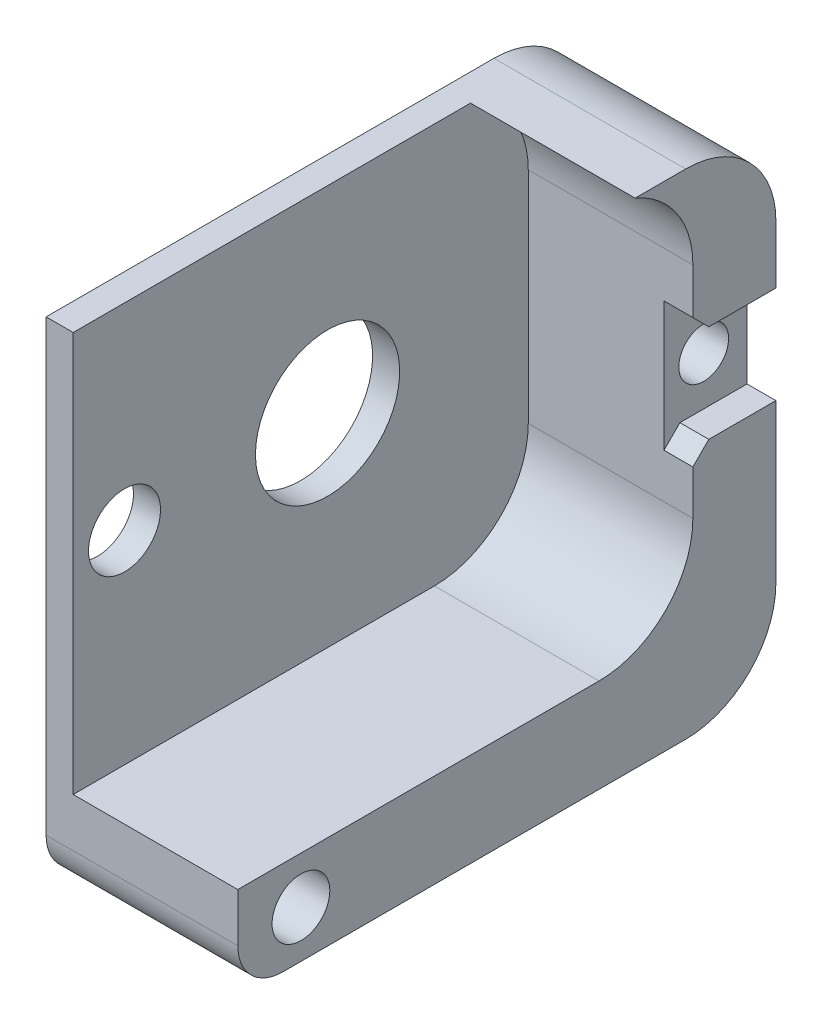
ISO-10303-21;
HEADER;
FILE_DESCRIPTION(('STEP AP214'),'2;1');
FILE_NAME('part.step','',(''),(''),'','','');
FILE_SCHEMA(('AUTOMOTIVE_DESIGN { 1 0 10303 214 1 1 1 1 }'));
ENDSEC;
DATA;
#1=APPLICATION_CONTEXT('core data for automotive mechanical design processes');
#2=APPLICATION_PROTOCOL_DEFINITION('international standard','automotive_design',2000,#1);
#3=PRODUCT_CONTEXT('',#1,'mechanical');
#4=PRODUCT('Part','Part','',(#3));
#5=PRODUCT_RELATED_PRODUCT_CATEGORY('part','',(#4));
#6=PRODUCT_DEFINITION_FORMATION('','',#4);
#7=PRODUCT_DEFINITION_CONTEXT('part definition',#1,'design');
#8=PRODUCT_DEFINITION('design','',#6,#7);
#9=PRODUCT_DEFINITION_SHAPE('','',#8);
#10=(LENGTH_UNIT() NAMED_UNIT(*) SI_UNIT(.MILLI.,.METRE.));
#11=(NAMED_UNIT(*) PLANE_ANGLE_UNIT() SI_UNIT($,.RADIAN.));
#12=(NAMED_UNIT(*) SI_UNIT($,.STERADIAN.) SOLID_ANGLE_UNIT());
#13=UNCERTAINTY_MEASURE_WITH_UNIT(LENGTH_MEASURE(1.E-05),#10,'distance_accuracy_value','');
#14=(GEOMETRIC_REPRESENTATION_CONTEXT(3) GLOBAL_UNCERTAINTY_ASSIGNED_CONTEXT((#13)) GLOBAL_UNIT_ASSIGNED_CONTEXT((#10,
#11,#12)) REPRESENTATION_CONTEXT('',''));
#15=CARTESIAN_POINT('',(0.,0.,0.));
#16=DIRECTION('',(0.,0.,1.));
#17=DIRECTION('',(1.,0.,0.));
#18=AXIS2_PLACEMENT_3D('',#15,#16,#17);
#19=CARTESIAN_POINT('',(-11.1667096211268,-21.3231281442154,-17.4703443811633));
#20=DIRECTION('',(1.,0.,0.));
#21=DIRECTION('',(0.,0.,-1.));
#22=AXIS2_PLACEMENT_3D('',#19,#20,#21);
#23=PLANE('',#22);
#24=CARTESIAN_POINT('',(-11.1667096211268,-18.8231281442155,-15.0703443811633));
#25=DIRECTION('',(1.,0.,0.));
#26=DIRECTION('',(0.,0.,-1.));
#27=AXIS2_PLACEMENT_3D('',#24,#25,#26);
#28=CIRCLE('',#27,1.38000000000005);
#29=CARTESIAN_POINT('',(-11.1667096211268,-18.8231281442155,-16.4503443811633));
#30=VERTEX_POINT('',#29);
#31=EDGE_CURVE('E13',#30,#30,#28,.F.);
#32=ORIENTED_EDGE('',*,*,#31,.T.);
#33=EDGE_LOOP('',(#32));
#34=FACE_BOUND('',#33,.T.);
#35=DIRECTION('',(0.,-1.,0.));
#36=VECTOR('',#35,1.);
#37=CARTESIAN_POINT('',(-11.1667096211268,0.,-17.4703443811632));
#38=LINE('',#37,#36);
#39=CARTESIAN_POINT('',(-11.1667096211268,-16.1231281442156,-17.4703443811632));
#40=VERTEX_POINT('',#39);
#41=CARTESIAN_POINT('',(-11.1667096211268,-21.5231281442154,-17.4703443811632));
#42=VERTEX_POINT('',#41);
#43=EDGE_CURVE('E418',#40,#42,#38,.T.);
#44=ORIENTED_EDGE('',*,*,#43,.F.);
#45=DIRECTION('',(0.,0.,-1.));
#46=VECTOR('',#45,1.);
#47=CARTESIAN_POINT('',(-11.1667096211268,-16.1231281442156,-17.4703443811633));
#48=LINE('',#47,#46);
#49=CARTESIAN_POINT('',(-11.1667096211268,-16.1231281442156,-13.7531870936376));
#50=VERTEX_POINT('',#49);
#51=EDGE_CURVE('E349',#50,#40,#48,.T.);
#52=ORIENTED_EDGE('',*,*,#51,.F.);
#53=DIRECTION('',(0.,-0.707106781186725,-0.70710678118637));
#54=VECTOR('',#53,1.);
#55=CARTESIAN_POINT('',(-11.1667096211268,-20.5817067879796,-18.2117657373994));
#56=LINE('',#55,#54);
#57=CARTESIAN_POINT('',(-11.1667096211268,-15.2402854317408,-12.8703443811633));
#58=VERTEX_POINT('',#57);
#59=EDGE_CURVE('E346',#58,#50,#56,.T.);
#60=ORIENTED_EDGE('',*,*,#59,.F.);
#61=DIRECTION('',(0.,1.,0.));
#62=VECTOR('',#61,1.);
#63=CARTESIAN_POINT('',(-11.1667096211268,0.,-12.8703443811633));
#64=LINE('',#63,#62);
#65=CARTESIAN_POINT('',(-11.1667096211268,-22.4059708566895,-12.8703443811633));
#66=VERTEX_POINT('',#65);
#67=EDGE_CURVE('E192',#66,#58,#64,.T.);
#68=ORIENTED_EDGE('',*,*,#67,.F.);
#69=DIRECTION('',(0.,-0.707106781186459,0.707106781186637));
#70=VECTOR('',#69,1.);
#71=CARTESIAN_POINT('',(-11.1667096211268,-19.5645495004526,-15.7117657374009));
#72=LINE('',#71,#70);
#73=CARTESIAN_POINT('',(-11.1667096211268,-21.5231281442154,-13.7531870936376));
#74=VERTEX_POINT('',#73);
#75=EDGE_CURVE('E407',#74,#66,#72,.T.);
#76=ORIENTED_EDGE('',*,*,#75,.F.);
#77=DIRECTION('',(0.,0.,1.));
#78=VECTOR('',#77,1.);
#79=CARTESIAN_POINT('',(-11.1667096211268,-21.5231281442154,-17.4703443811633));
#80=LINE('',#79,#78);
#81=EDGE_CURVE('E404',#42,#74,#80,.T.);
#82=ORIENTED_EDGE('',*,*,#81,.F.);
#83=EDGE_LOOP('',(#44,#52,#60,#68,#76,#82));
#84=FACE_BOUND('',#83,.T.);
#85=ADVANCED_FACE('F169',(#34,#84),#23,.T.);
#86=CARTESIAN_POINT('',(29.5047288698509,0.,-17.4703443811632));
#87=DIRECTION('',(0.,0.,-1.));
#88=DIRECTION('',(-1.,0.,0.));
#89=AXIS2_PLACEMENT_3D('',#86,#87,#88);
#90=PLANE('',#89);
#91=DIRECTION('',(-1.,0.,0.));
#92=VECTOR('',#91,1.);
#93=CARTESIAN_POINT('',(29.5047288698509,-12.9081281442156,-17.4703443811632));
#94=LINE('',#93,#92);
#95=CARTESIAN_POINT('',(-9.56670962112671,-12.9081281442156,-17.4703443811631));
#96=VERTEX_POINT('',#95);
#97=CARTESIAN_POINT('',(-20.1867111341527,-12.9081281442156,-17.4703443811631));
#98=VERTEX_POINT('',#97);
#99=EDGE_CURVE('E437',#96,#98,#94,.T.);
#100=ORIENTED_EDGE('',*,*,#99,.F.);
#101=DIRECTION('',(0.,1.,0.));
#102=VECTOR('',#101,1.);
#103=CARTESIAN_POINT('',(-9.56670962112671,-21.3231281442154,-17.4703443811632));
#104=LINE('',#103,#102);
#105=CARTESIAN_POINT('',(-9.56670962112671,-16.1231281442156,-17.4703443811632));
#106=VERTEX_POINT('',#105);
#107=EDGE_CURVE('E366',#106,#96,#104,.T.);
#108=ORIENTED_EDGE('',*,*,#107,.F.);
#109=DIRECTION('',(-1.,0.,0.));
#110=VECTOR('',#109,1.);
#111=CARTESIAN_POINT('',(23.2673742763642,-16.1231281442156,-17.4703443811632));
#112=LINE('',#111,#110);
#113=EDGE_CURVE('E352',#106,#40,#112,.T.);
#114=ORIENTED_EDGE('',*,*,#113,.T.);
#115=ORIENTED_EDGE('',*,*,#43,.T.);
#116=DIRECTION('',(-1.,0.,0.));
#117=VECTOR('',#116,1.);
#118=CARTESIAN_POINT('',(23.2673742763642,-21.5231281442154,-17.4703443811632));
#119=LINE('',#118,#117);
#120=CARTESIAN_POINT('',(-9.56670962112671,-21.5231281442154,-17.4703443811632));
#121=VERTEX_POINT('',#120);
#122=EDGE_CURVE('E415',#121,#42,#119,.T.);
#123=ORIENTED_EDGE('',*,*,#122,.F.);
#124=DIRECTION('',(0.,1.,0.));
#125=VECTOR('',#124,1.);
#126=CARTESIAN_POINT('',(-9.56670962112671,-21.3231281442154,-17.4703443811632));
#127=LINE('',#126,#125);
#128=CARTESIAN_POINT('',(-9.56670962112671,-30.276049302552,-17.4703443811634));
#129=VERTEX_POINT('',#128);
#130=EDGE_CURVE('E383',#129,#121,#127,.T.);
#131=ORIENTED_EDGE('',*,*,#130,.F.);
#132=DIRECTION('',(-1.,0.,0.));
#133=VECTOR('',#132,1.);
#134=CARTESIAN_POINT('',(29.5047288698509,-30.276049302552,-17.4703443811634));
#135=LINE('',#134,#133);
#136=CARTESIAN_POINT('',(-20.1867111341527,-30.276049302552,-17.4703443811634));
#137=VERTEX_POINT('',#136);
#138=EDGE_CURVE('E172',#129,#137,#135,.T.);
#139=ORIENTED_EDGE('',*,*,#138,.T.);
#140=DIRECTION('',(0.,1.,0.));
#141=VECTOR('',#140,1.);
#142=CARTESIAN_POINT('',(-20.1867111341527,2.21594348095144E-13,-17.470344381163));
#143=LINE('',#142,#141);
#144=EDGE_CURVE('E333',#137,#98,#143,.T.);
#145=ORIENTED_EDGE('',*,*,#144,.T.);
#146=EDGE_LOOP('',(#100,#108,#114,#115,#123,#131,#139,#145));
#147=FACE_BOUND('',#146,.T.);
#148=ADVANCED_FACE('F484',(#147),#90,.T.);
#149=CARTESIAN_POINT('',(29.5047288698509,-12.9081281442156,-12.4703443811631));
#150=DIRECTION('',(-1.,0.,0.));
#151=DIRECTION('',(0.,0.,1.));
#152=AXIS2_PLACEMENT_3D('',#149,#150,#151);
#153=CYLINDRICAL_SURFACE('',#152,5.);
#154=DIRECTION('',(-1.,0.,0.));
#155=VECTOR('',#154,1.);
#156=CARTESIAN_POINT('',(29.5047288698509,-7.90812814421571,-12.4703443811631));
#157=LINE('',#156,#155);
#158=CARTESIAN_POINT('',(-9.56670962112671,-7.90812814421571,-12.4703443811631));
#159=VERTEX_POINT('',#158);
#160=CARTESIAN_POINT('',(-20.1867111341527,-7.9081281442156,-12.4703443811631));
#161=VERTEX_POINT('',#160);
#162=EDGE_CURVE('E439',#159,#161,#157,.T.);
#163=ORIENTED_EDGE('',*,*,#162,.F.);
#164=CARTESIAN_POINT('',(-9.56670962112671,-12.9081281442156,-12.4703443811631));
#165=DIRECTION('',(1.,0.,0.));
#166=DIRECTION('',(0.,0.,-1.));
#167=AXIS2_PLACEMENT_3D('',#164,#165,#166);
#168=CIRCLE('',#167,5.);
#169=EDGE_CURVE('E363',#96,#159,#168,.T.);
#170=ORIENTED_EDGE('',*,*,#169,.F.);
#171=ORIENTED_EDGE('',*,*,#99,.T.);
#172=CARTESIAN_POINT('',(-20.1867111341527,-12.9081281442156,-12.4703443811631));
#173=DIRECTION('',(-1.,0.,0.));
#174=DIRECTION('',(0.,0.,1.));
#175=AXIS2_PLACEMENT_3D('',#172,#173,#174);
#176=CIRCLE('',#175,5.);
#177=EDGE_CURVE('E327',#161,#98,#176,.T.);
#178=ORIENTED_EDGE('',*,*,#177,.F.);
#179=EDGE_LOOP('',(#163,#170,#171,#178));
#180=FACE_BOUND('',#179,.T.);
#181=ADVANCED_FACE('F482',(#180),#153,.T.);
#182=CARTESIAN_POINT('',(29.5047288698509,-7.90812814421571,0.));
#183=DIRECTION('',(0.,1.,0.));
#184=DIRECTION('',(0.,0.,1.));
#185=AXIS2_PLACEMENT_3D('',#182,#183,#184);
#186=PLANE('',#185);
#187=DIRECTION('',(-1.,0.,0.));
#188=VECTOR('',#187,1.);
#189=CARTESIAN_POINT('',(29.5047288698509,-7.90812814421571,-9.6703443811631));
#190=LINE('',#189,#188);
#191=CARTESIAN_POINT('',(-9.56670962112671,-7.90812814421564,-9.67034438116313));
#192=VERTEX_POINT('',#191);
#193=CARTESIAN_POINT('',(-18.6867111341527,-7.90812814421566,-9.67034438116317));
#194=VERTEX_POINT('',#193);
#195=EDGE_CURVE('E424',#192,#194,#190,.T.);
#196=ORIENTED_EDGE('',*,*,#195,.F.);
#197=DIRECTION('',(0.,0.,1.));
#198=VECTOR('',#197,1.);
#199=CARTESIAN_POINT('',(-9.56670962112671,-7.90812814421571,-17.4703443811633));
#200=LINE('',#199,#198);
#201=EDGE_CURVE('E357',#159,#192,#200,.T.);
#202=ORIENTED_EDGE('',*,*,#201,.F.);
#203=ORIENTED_EDGE('',*,*,#162,.T.);
#204=DIRECTION('',(0.,0.,-1.));
#205=VECTOR('',#204,1.);
#206=CARTESIAN_POINT('',(-20.1867111341527,-7.90812814421549,1.41523851660597E-13));
#207=LINE('',#206,#205);
#208=CARTESIAN_POINT('',(-20.1867111341527,-7.90812814421527,12.3446556188369));
#209=VERTEX_POINT('',#208);
#210=EDGE_CURVE('E325',#209,#161,#207,.T.);
#211=ORIENTED_EDGE('',*,*,#210,.F.);
#212=DIRECTION('',(1.,0.,0.));
#213=VECTOR('',#212,1.);
#214=CARTESIAN_POINT('',(-20.1867111341527,-7.90812814421527,12.3446556188369));
#215=LINE('',#214,#213);
#216=CARTESIAN_POINT('',(-18.6867111341527,-7.90812814421527,12.3446556188369));
#217=VERTEX_POINT('',#216);
#218=EDGE_CURVE('E323',#209,#217,#215,.T.);
#219=ORIENTED_EDGE('',*,*,#218,.T.);
#220=DIRECTION('',(0.,0.,-1.));
#221=VECTOR('',#220,1.);
#222=CARTESIAN_POINT('',(-18.6867111341527,-7.90812814421549,1.41523851660597E-13));
#223=LINE('',#222,#221);
#224=EDGE_CURVE('E319',#217,#194,#223,.T.);
#225=ORIENTED_EDGE('',*,*,#224,.T.);
#226=EDGE_LOOP('',(#196,#202,#203,#211,#219,#225));
#227=FACE_BOUND('',#226,.T.);
#228=ADVANCED_FACE('F471',(#227),#186,.T.);
#229=CARTESIAN_POINT('',(29.5047288698509,-12.7081281442156,-7.67034438116332));
#230=DIRECTION('',(-1.,0.,0.));
#231=DIRECTION('',(0.,0.,1.));
#232=AXIS2_PLACEMENT_3D('',#229,#230,#231);
#233=CYLINDRICAL_SURFACE('',#232,5.19999999999991);
#234=DIRECTION('',(-1.,0.,0.));
#235=VECTOR('',#234,1.);
#236=CARTESIAN_POINT('',(29.5047288698509,-12.7081281442156,-12.8703443811633));
#237=LINE('',#236,#235);
#238=CARTESIAN_POINT('',(-9.56670962112671,-12.7081281442156,-12.8703443811633));
#239=VERTEX_POINT('',#238);
#240=CARTESIAN_POINT('',(-18.6867111341527,-12.7081281442156,-12.8703443811633));
#241=VERTEX_POINT('',#240);
#242=EDGE_CURVE('E436',#239,#241,#237,.T.);
#243=ORIENTED_EDGE('',*,*,#242,.F.);
#244=CARTESIAN_POINT('',(-9.56670962112671,-12.7081281442156,-7.67034438116332));
#245=DIRECTION('',(1.,0.,0.));
#246=DIRECTION('',(0.,0.,-1.));
#247=AXIS2_PLACEMENT_3D('',#244,#245,#246);
#248=CIRCLE('',#247,5.19999999999991);
#249=EDGE_CURVE('E358',#239,#192,#248,.T.);
#250=ORIENTED_EDGE('',*,*,#249,.T.);
#251=ORIENTED_EDGE('',*,*,#195,.T.);
#252=CARTESIAN_POINT('',(-18.6867111341527,-12.7081281442156,-7.67034438116332));
#253=DIRECTION('',(-1.,0.,0.));
#254=DIRECTION('',(0.,0.,1.));
#255=AXIS2_PLACEMENT_3D('',#252,#253,#254);
#256=CIRCLE('',#255,5.19999999999991);
#257=EDGE_CURVE('E421',#194,#241,#256,.T.);
#258=ORIENTED_EDGE('',*,*,#257,.T.);
#259=EDGE_LOOP('',(#243,#250,#251,#258));
#260=FACE_BOUND('',#259,.T.);
#261=ADVANCED_FACE('F474',(#260),#233,.F.);
#262=CARTESIAN_POINT('',(29.5047288698509,0.,-12.8703443811633));
#263=DIRECTION('',(0.,0.,1.));
#264=DIRECTION('',(1.,0.,0.));
#265=AXIS2_PLACEMENT_3D('',#262,#263,#264);
#266=PLANE('',#265);
#267=DIRECTION('',(-1.,0.,0.));
#268=VECTOR('',#267,1.);
#269=CARTESIAN_POINT('',(29.5047288698509,-24.876049302553,-12.8703443811633));
#270=LINE('',#269,#268);
#271=CARTESIAN_POINT('',(-9.56670962112671,-24.876049302553,-12.8703443811632));
#272=VERTEX_POINT('',#271);
#273=CARTESIAN_POINT('',(-18.6867111341527,-24.876049302553,-12.8703443811633));
#274=VERTEX_POINT('',#273);
#275=EDGE_CURVE('E431',#272,#274,#270,.T.);
#276=ORIENTED_EDGE('',*,*,#275,.F.);
#277=DIRECTION('',(0.,-1.,2.69681238622375E-13));
#278=VECTOR('',#277,1.);
#279=CARTESIAN_POINT('',(-9.56670962112671,-21.3231281442142,-12.8703443811643));
#280=LINE('',#279,#278);
#281=CARTESIAN_POINT('',(-9.56670962112671,-22.4059708566888,-12.870344381164));
#282=VERTEX_POINT('',#281);
#283=EDGE_CURVE('E401',#282,#272,#280,.T.);
#284=ORIENTED_EDGE('',*,*,#283,.F.);
#285=DIRECTION('',(-1.,0.,0.));
#286=VECTOR('',#285,1.);
#287=CARTESIAN_POINT('',(23.2673742763642,-22.4059708566888,-12.870344381164));
#288=LINE('',#287,#286);
#289=EDGE_CURVE('E410',#282,#66,#288,.T.);
#290=ORIENTED_EDGE('',*,*,#289,.T.);
#291=ORIENTED_EDGE('',*,*,#67,.T.);
#292=DIRECTION('',(-1.,0.,0.));
#293=VECTOR('',#292,1.);
#294=CARTESIAN_POINT('',(23.2673742763642,-15.2402854317408,-12.8703443811633));
#295=LINE('',#294,#293);
#296=CARTESIAN_POINT('',(-9.56670962112671,-15.2402854317408,-12.8703443811633));
#297=VERTEX_POINT('',#296);
#298=EDGE_CURVE('E185',#297,#58,#295,.T.);
#299=ORIENTED_EDGE('',*,*,#298,.F.);
#300=DIRECTION('',(0.,-1.,0.));
#301=VECTOR('',#300,1.);
#302=CARTESIAN_POINT('',(-9.56670962112671,-21.3231281442154,-12.8703443811633));
#303=LINE('',#302,#301);
#304=EDGE_CURVE('E353',#239,#297,#303,.T.);
#305=ORIENTED_EDGE('',*,*,#304,.F.);
#306=ORIENTED_EDGE('',*,*,#242,.T.);
#307=DIRECTION('',(0.,1.,0.));
#308=VECTOR('',#307,1.);
#309=CARTESIAN_POINT('',(-18.6867111341527,0.,-12.8703443811633));
#310=LINE('',#309,#308);
#311=EDGE_CURVE('E177',#274,#241,#310,.T.);
#312=ORIENTED_EDGE('',*,*,#311,.F.);
#313=EDGE_LOOP('',(#276,#284,#290,#291,#299,#305,#306,#312));
#314=FACE_BOUND('',#313,.T.);
#315=ADVANCED_FACE('F496',(#314),#266,.T.);
#316=CARTESIAN_POINT('',(29.5047288698509,-24.876049302553,-7.67034438116332));
#317=DIRECTION('',(-1.,0.,0.));
#318=DIRECTION('',(0.,0.,1.));
#319=AXIS2_PLACEMENT_3D('',#316,#317,#318);
#320=CYLINDRICAL_SURFACE('',#319,5.19999999999993);
#321=DIRECTION('',(-1.,0.,0.));
#322=VECTOR('',#321,1.);
#323=CARTESIAN_POINT('',(29.5047288698509,-30.0760493025529,-7.67034438116332));
#324=LINE('',#323,#322);
#325=CARTESIAN_POINT('',(-9.56670962112671,-30.0760493025529,-7.67034438116332));
#326=VERTEX_POINT('',#325);
#327=CARTESIAN_POINT('',(-18.6867111341527,-30.0760493025529,-7.67034438116332));
#328=VERTEX_POINT('',#327);
#329=EDGE_CURVE('E430',#326,#328,#324,.T.);
#330=ORIENTED_EDGE('',*,*,#329,.F.);
#331=CARTESIAN_POINT('',(-9.56670962112671,-24.876049302553,-7.67034438116332));
#332=DIRECTION('',(1.,0.,0.));
#333=DIRECTION('',(0.,0.,-1.));
#334=AXIS2_PLACEMENT_3D('',#331,#332,#333);
#335=CIRCLE('',#334,5.19999999999993);
#336=EDGE_CURVE('E398',#326,#272,#335,.T.);
#337=ORIENTED_EDGE('',*,*,#336,.T.);
#338=ORIENTED_EDGE('',*,*,#275,.T.);
#339=CARTESIAN_POINT('',(-18.6867111341527,-24.876049302553,-7.67034438116332));
#340=DIRECTION('',(-1.,0.,0.));
#341=DIRECTION('',(0.,0.,1.));
#342=AXIS2_PLACEMENT_3D('',#339,#340,#341);
#343=CIRCLE('',#342,5.19999999999993);
#344=EDGE_CURVE('E427',#274,#328,#343,.T.);
#345=ORIENTED_EDGE('',*,*,#344,.T.);
#346=EDGE_LOOP('',(#330,#337,#338,#345));
#347=FACE_BOUND('',#346,.T.);
#348=ADVANCED_FACE('F499',(#347),#320,.F.);
#349=CARTESIAN_POINT('',(29.5047288698509,-30.0760493025529,0.));
#350=DIRECTION('',(0.,1.,0.));
#351=DIRECTION('',(0.,0.,1.));
#352=AXIS2_PLACEMENT_3D('',#349,#350,#351);
#353=PLANE('',#352);
#354=DIRECTION('',(-1.,0.,0.));
#355=VECTOR('',#354,1.);
#356=CARTESIAN_POINT('',(29.5047288698509,-30.0760493025529,12.3446556188369));
#357=LINE('',#356,#355);
#358=CARTESIAN_POINT('',(-9.56670962112671,-30.0760493025529,12.3446556188369));
#359=VERTEX_POINT('',#358);
#360=CARTESIAN_POINT('',(-18.6867111341527,-30.0760493025529,12.3446556188369));
#361=VERTEX_POINT('',#360);
#362=EDGE_CURVE('E308',#359,#361,#357,.T.);
#363=ORIENTED_EDGE('',*,*,#362,.F.);
#364=DIRECTION('',(0.,0.,1.));
#365=VECTOR('',#364,1.);
#366=CARTESIAN_POINT('',(-9.56670962112671,-30.0760493025529,-17.4703443811633));
#367=LINE('',#366,#365);
#368=EDGE_CURVE('E395',#326,#359,#367,.T.);
#369=ORIENTED_EDGE('',*,*,#368,.F.);
#370=ORIENTED_EDGE('',*,*,#329,.T.);
#371=DIRECTION('',(0.,0.,-1.));
#372=VECTOR('',#371,1.);
#373=CARTESIAN_POINT('',(-18.6867111341527,-30.0760493025529,0.));
#374=LINE('',#373,#372);
#375=EDGE_CURVE('E426',#361,#328,#374,.T.);
#376=ORIENTED_EDGE('',*,*,#375,.F.);
#377=EDGE_LOOP('',(#363,#369,#370,#376));
#378=FACE_BOUND('',#377,.T.);
#379=ADVANCED_FACE('F465',(#378),#353,.T.);
#380=CARTESIAN_POINT('',(29.5047288698509,0.,12.3446556188369));
#381=DIRECTION('',(0.,0.,1.));
#382=DIRECTION('',(1.,0.,0.));
#383=AXIS2_PLACEMENT_3D('',#380,#381,#382);
#384=PLANE('',#383);
#385=DIRECTION('',(-1.,0.,0.));
#386=VECTOR('',#385,1.);
#387=CARTESIAN_POINT('',(29.5047288698509,-32.7760493025524,12.3446556188369));
#388=LINE('',#387,#386);
#389=CARTESIAN_POINT('',(-9.56670962112671,-32.7760493025524,12.3446556188371));
#390=VERTEX_POINT('',#389);
#391=CARTESIAN_POINT('',(-20.1867111341527,-32.7760493025524,12.3446556188369));
#392=VERTEX_POINT('',#391);
#393=EDGE_CURVE('E296',#390,#392,#388,.T.);
#394=ORIENTED_EDGE('',*,*,#393,.F.);
#395=DIRECTION('',(0.,-1.,0.));
#396=VECTOR('',#395,1.);
#397=CARTESIAN_POINT('',(-9.56670962112671,-21.3231281442154,12.3446556188369));
#398=LINE('',#397,#396);
#399=EDGE_CURVE('E393',#359,#390,#398,.T.);
#400=ORIENTED_EDGE('',*,*,#399,.F.);
#401=ORIENTED_EDGE('',*,*,#362,.T.);
#402=DIRECTION('',(0.,-1.,0.));
#403=VECTOR('',#402,1.);
#404=CARTESIAN_POINT('',(-18.6867111341527,0.,12.3446556188369));
#405=LINE('',#404,#403);
#406=EDGE_CURVE('E339',#217,#361,#405,.T.);
#407=ORIENTED_EDGE('',*,*,#406,.F.);
#408=ORIENTED_EDGE('',*,*,#218,.F.);
#409=DIRECTION('',(0.,-1.,0.));
#410=VECTOR('',#409,1.);
#411=CARTESIAN_POINT('',(-20.1867111341527,0.,12.3446556188369));
#412=LINE('',#411,#410);
#413=EDGE_CURVE('E315',#209,#392,#412,.T.);
#414=ORIENTED_EDGE('',*,*,#413,.T.);
#415=EDGE_LOOP('',(#394,#400,#401,#407,#408,#414));
#416=FACE_BOUND('',#415,.T.);
#417=ADVANCED_FACE('F321',(#416),#384,.T.);
#418=CARTESIAN_POINT('',(29.5047288698509,-32.7760493025524,9.84465561883696));
#419=DIRECTION('',(-1.,0.,0.));
#420=DIRECTION('',(0.,0.,1.));
#421=AXIS2_PLACEMENT_3D('',#418,#419,#420);
#422=CYLINDRICAL_SURFACE('',#421,2.50000000000017);
#423=DIRECTION('',(-1.,0.,0.));
#424=VECTOR('',#423,1.);
#425=CARTESIAN_POINT('',(29.5047288698509,-35.2760493025528,9.84465561883696));
#426=LINE('',#425,#424);
#427=CARTESIAN_POINT('',(-9.56670962112671,-35.2760493025528,9.84465561883696));
#428=VERTEX_POINT('',#427);
#429=CARTESIAN_POINT('',(-20.1867111341527,-35.2760493025528,9.84465561883696));
#430=VERTEX_POINT('',#429);
#431=EDGE_CURVE('E307',#428,#430,#426,.T.);
#432=ORIENTED_EDGE('',*,*,#431,.F.);
#433=CARTESIAN_POINT('',(-9.56670962112671,-32.7760493025524,9.84465561883696));
#434=DIRECTION('',(1.,0.,0.));
#435=DIRECTION('',(0.,0.,-1.));
#436=AXIS2_PLACEMENT_3D('',#433,#434,#435);
#437=CIRCLE('',#436,2.50000000000017);
#438=EDGE_CURVE('E302',#390,#428,#437,.T.);
#439=ORIENTED_EDGE('',*,*,#438,.F.);
#440=ORIENTED_EDGE('',*,*,#393,.T.);
#441=CARTESIAN_POINT('',(-20.1867111341527,-32.7760493025524,9.84465561883696));
#442=DIRECTION('',(-1.,0.,0.));
#443=DIRECTION('',(0.,0.,1.));
#444=AXIS2_PLACEMENT_3D('',#441,#442,#443);
#445=CIRCLE('',#444,2.50000000000017);
#446=EDGE_CURVE('E299',#430,#392,#445,.T.);
#447=ORIENTED_EDGE('',*,*,#446,.F.);
#448=EDGE_LOOP('',(#432,#439,#440,#447));
#449=FACE_BOUND('',#448,.T.);
#450=ADVANCED_FACE('F298',(#449),#422,.T.);
#451=CARTESIAN_POINT('',(29.5047288698509,-35.2760493025526,-7.02026119713304E-13));
#452=DIRECTION('',(0.,-1.,0.));
#453=DIRECTION('',(0.,0.,-1.));
#454=AXIS2_PLACEMENT_3D('',#451,#452,#453);
#455=PLANE('',#454);
#456=DIRECTION('',(-1.,0.,0.));
#457=VECTOR('',#456,1.);
#458=CARTESIAN_POINT('',(29.5047288698509,-35.2760493025524,-12.4703443811631));
#459=LINE('',#458,#457);
#460=CARTESIAN_POINT('',(-9.56670962112671,-35.2760493025523,-12.4703443811631));
#461=VERTEX_POINT('',#460);
#462=CARTESIAN_POINT('',(-20.1867111341527,-35.2760493025524,-12.4703443811631));
#463=VERTEX_POINT('',#462);
#464=EDGE_CURVE('E432',#461,#463,#459,.T.);
#465=ORIENTED_EDGE('',*,*,#464,.F.);
#466=DIRECTION('',(0.,0.,-1.));
#467=VECTOR('',#466,1.);
#468=CARTESIAN_POINT('',(-9.56670962112671,-35.2760493025523,-17.4703443811636));
#469=LINE('',#468,#467);
#470=EDGE_CURVE('E389',#428,#461,#469,.T.);
#471=ORIENTED_EDGE('',*,*,#470,.F.);
#472=ORIENTED_EDGE('',*,*,#431,.T.);
#473=DIRECTION('',(0.,0.,-1.));
#474=VECTOR('',#473,1.);
#475=CARTESIAN_POINT('',(-20.1867111341527,-35.2760493025526,-7.02026119713304E-13));
#476=LINE('',#475,#474);
#477=EDGE_CURVE('E318',#430,#463,#476,.T.);
#478=ORIENTED_EDGE('',*,*,#477,.T.);
#479=EDGE_LOOP('',(#465,#471,#472,#478));
#480=FACE_BOUND('',#479,.T.);
#481=ADVANCED_FACE('F458',(#480),#455,.T.);
#482=CARTESIAN_POINT('',(29.5047288698509,-18.8231281442155,-15.0703443811633));
#483=DIRECTION('',(-1.,0.,0.));
#484=DIRECTION('',(0.,0.,1.));
#485=AXIS2_PLACEMENT_3D('',#482,#483,#484);
#486=CYLINDRICAL_SURFACE('',#485,1.38000000000005);
#487=ORIENTED_EDGE('',*,*,#31,.F.);
#488=EDGE_LOOP('',(#487));
#489=FACE_BOUND('',#488,.T.);
#490=CARTESIAN_POINT('',(-20.1867111341527,-18.8231281442155,-15.0703443811633));
#491=DIRECTION('',(-1.,0.,0.));
#492=DIRECTION('',(0.,0.,1.));
#493=AXIS2_PLACEMENT_3D('',#490,#491,#492);
#494=CIRCLE('',#493,1.38000000000005);
#495=CARTESIAN_POINT('',(-20.1867111341527,-18.8231281442155,-13.6903443811632));
#496=VERTEX_POINT('',#495);
#497=EDGE_CURVE('E520',#496,#496,#494,.T.);
#498=ORIENTED_EDGE('',*,*,#497,.T.);
#499=EDGE_LOOP('',(#498));
#500=FACE_BOUND('',#499,.T.);
#501=ADVANCED_FACE('F514',(#489,#500),#486,.F.);
#502=CARTESIAN_POINT('',(29.5047288698509,-30.276049302552,-12.4703443811631));
#503=DIRECTION('',(-1.,0.,0.));
#504=DIRECTION('',(0.,0.,1.));
#505=AXIS2_PLACEMENT_3D('',#502,#503,#504);
#506=CYLINDRICAL_SURFACE('',#505,5.00000000000028);
#507=ORIENTED_EDGE('',*,*,#138,.F.);
#508=CARTESIAN_POINT('',(-9.56670962112671,-30.276049302552,-12.4703443811631));
#509=DIRECTION('',(1.,0.,0.));
#510=DIRECTION('',(0.,0.,-1.));
#511=AXIS2_PLACEMENT_3D('',#508,#509,#510);
#512=CIRCLE('',#511,5.00000000000028);
#513=EDGE_CURVE('E386',#461,#129,#512,.T.);
#514=ORIENTED_EDGE('',*,*,#513,.F.);
#515=ORIENTED_EDGE('',*,*,#464,.T.);
#516=CARTESIAN_POINT('',(-20.1867111341527,-30.276049302552,-12.4703443811631));
#517=DIRECTION('',(-1.,0.,0.));
#518=DIRECTION('',(0.,0.,1.));
#519=AXIS2_PLACEMENT_3D('',#516,#517,#518);
#520=CIRCLE('',#519,5.00000000000028);
#521=EDGE_CURVE('E336',#137,#463,#520,.T.);
#522=ORIENTED_EDGE('',*,*,#521,.F.);
#523=EDGE_LOOP('',(#507,#514,#515,#522));
#524=FACE_BOUND('',#523,.T.);
#525=ADVANCED_FACE('F454',(#524),#506,.T.);
#526=CARTESIAN_POINT('',(29.5047288698509,-32.6760493025526,8.84465561883685));
#527=DIRECTION('',(-1.,0.,0.));
#528=DIRECTION('',(0.,0.,1.));
#529=AXIS2_PLACEMENT_3D('',#526,#527,#528);
#530=CYLINDRICAL_SURFACE('',#529,1.59999999999949);
#531=CARTESIAN_POINT('',(-9.56670962112671,-32.6760493025526,8.84465561883685));
#532=DIRECTION('',(1.,0.,0.));
#533=DIRECTION('',(0.,0.,-1.));
#534=AXIS2_PLACEMENT_3D('',#531,#532,#533);
#535=CIRCLE('',#534,1.59999999999949);
#536=CARTESIAN_POINT('',(-9.56670962112671,-32.6760493025526,7.24465561883736));
#537=VERTEX_POINT('',#536);
#538=EDGE_CURVE('E356',#537,#537,#535,.T.);
#539=ORIENTED_EDGE('',*,*,#538,.T.);
#540=EDGE_LOOP('',(#539));
#541=FACE_BOUND('',#540,.T.);
#542=CARTESIAN_POINT('',(-20.1867111341527,-32.6760493025526,8.84465561883685));
#543=DIRECTION('',(-1.,0.,0.));
#544=DIRECTION('',(0.,0.,1.));
#545=AXIS2_PLACEMENT_3D('',#542,#543,#544);
#546=CIRCLE('',#545,1.59999999999949);
#547=CARTESIAN_POINT('',(-20.1867111341527,-32.6760493025526,10.4446556188363));
#548=VERTEX_POINT('',#547);
#549=EDGE_CURVE('E522',#548,#548,#546,.T.);
#550=ORIENTED_EDGE('',*,*,#549,.T.);
#551=EDGE_LOOP('',(#550));
#552=FACE_BOUND('',#551,.T.);
#553=ADVANCED_FACE('F566',(#541,#552),#530,.F.);
#554=CARTESIAN_POINT('',(23.2673742763642,-19.5645495004526,-15.7117657374009));
#555=DIRECTION('',(0.,-0.707106781186637,-0.707106781186459));
#556=DIRECTION('',(0.,0.707106781186459,-0.707106781186637));
#557=AXIS2_PLACEMENT_3D('',#554,#555,#556);
#558=PLANE('',#557);
#559=DIRECTION('',(0.,-0.707106781186459,0.707106781186637));
#560=VECTOR('',#559,1.);
#561=CARTESIAN_POINT('',(-9.56670962112671,-19.5645495004526,-15.7117657374009));
#562=LINE('',#561,#560);
#563=CARTESIAN_POINT('',(-9.56670962112671,-21.5231281442154,-13.7531870936376));
#564=VERTEX_POINT('',#563);
#565=EDGE_CURVE('E377',#564,#282,#562,.T.);
#566=ORIENTED_EDGE('',*,*,#565,.F.);
#567=DIRECTION('',(-1.,0.,0.));
#568=VECTOR('',#567,1.);
#569=CARTESIAN_POINT('',(23.2673742763642,-21.5231281442154,-13.7531870936376));
#570=LINE('',#569,#568);
#571=EDGE_CURVE('E412',#564,#74,#570,.T.);
#572=ORIENTED_EDGE('',*,*,#571,.T.);
#573=ORIENTED_EDGE('',*,*,#75,.T.);
#574=ORIENTED_EDGE('',*,*,#289,.F.);
#575=EDGE_LOOP('',(#566,#572,#573,#574));
#576=FACE_BOUND('',#575,.T.);
#577=ADVANCED_FACE('F493',(#576),#558,.F.);
#578=CARTESIAN_POINT('',(23.2673742763642,-21.5231281442154,-17.4703443811633));
#579=DIRECTION('',(0.,-1.,0.));
#580=DIRECTION('',(0.,0.,-1.));
#581=AXIS2_PLACEMENT_3D('',#578,#579,#580);
#582=PLANE('',#581);
#583=DIRECTION('',(0.,0.,1.));
#584=VECTOR('',#583,1.);
#585=CARTESIAN_POINT('',(-9.56670962112671,-21.5231281442154,-17.4703443811633));
#586=LINE('',#585,#584);
#587=EDGE_CURVE('E380',#121,#564,#586,.T.);
#588=ORIENTED_EDGE('',*,*,#587,.F.);
#589=ORIENTED_EDGE('',*,*,#122,.T.);
#590=ORIENTED_EDGE('',*,*,#81,.T.);
#591=ORIENTED_EDGE('',*,*,#571,.F.);
#592=EDGE_LOOP('',(#588,#589,#590,#591));
#593=FACE_BOUND('',#592,.T.);
#594=ADVANCED_FACE('F490',(#593),#582,.F.);
#595=CARTESIAN_POINT('',(-9.56670962112671,3103.5187899225,775.596806114293));
#596=DIRECTION('',(1.,0.,0.));
#597=DIRECTION('',(0.,0.,-1.));
#598=AXIS2_PLACEMENT_3D('',#595,#596,#597);
#599=PLANE('',#598);
#600=ORIENTED_EDGE('',*,*,#538,.F.);
#601=EDGE_LOOP('',(#600));
#602=FACE_BOUND('',#601,.T.);
#603=ORIENTED_EDGE('',*,*,#565,.T.);
#604=ORIENTED_EDGE('',*,*,#283,.T.);
#605=ORIENTED_EDGE('',*,*,#336,.F.);
#606=ORIENTED_EDGE('',*,*,#368,.T.);
#607=ORIENTED_EDGE('',*,*,#399,.T.);
#608=ORIENTED_EDGE('',*,*,#438,.T.);
#609=ORIENTED_EDGE('',*,*,#470,.T.);
#610=ORIENTED_EDGE('',*,*,#513,.T.);
#611=ORIENTED_EDGE('',*,*,#130,.T.);
#612=ORIENTED_EDGE('',*,*,#587,.T.);
#613=EDGE_LOOP('',(#603,#604,#605,#606,#607,#608,#609,#610,#611,#612));
#614=FACE_BOUND('',#613,.T.);
#615=ADVANCED_FACE('F460',(#602,#614),#599,.T.);
#616=CARTESIAN_POINT('',(23.2673742763642,-16.1231281442156,-17.4703443811633));
#617=DIRECTION('',(0.,1.,0.));
#618=DIRECTION('',(0.,0.,1.));
#619=AXIS2_PLACEMENT_3D('',#616,#617,#618);
#620=PLANE('',#619);
#621=DIRECTION('',(0.,0.,-1.));
#622=VECTOR('',#621,1.);
#623=CARTESIAN_POINT('',(-9.56670962112671,-16.1231281442156,-17.4703443811633));
#624=LINE('',#623,#622);
#625=CARTESIAN_POINT('',(-9.56670962112671,-16.1231281442156,-13.7531870936376));
#626=VERTEX_POINT('',#625);
#627=EDGE_CURVE('E369',#626,#106,#624,.T.);
#628=ORIENTED_EDGE('',*,*,#627,.F.);
#629=DIRECTION('',(-1.,0.,0.));
#630=VECTOR('',#629,1.);
#631=CARTESIAN_POINT('',(23.2673742763642,-16.1231281442156,-13.7531870936376));
#632=LINE('',#631,#630);
#633=EDGE_CURVE('E345',#626,#50,#632,.T.);
#634=ORIENTED_EDGE('',*,*,#633,.T.);
#635=ORIENTED_EDGE('',*,*,#51,.T.);
#636=ORIENTED_EDGE('',*,*,#113,.F.);
#637=EDGE_LOOP('',(#628,#634,#635,#636));
#638=FACE_BOUND('',#637,.T.);
#639=ADVANCED_FACE('F504',(#638),#620,.F.);
#640=CARTESIAN_POINT('',(23.2673742763642,-20.5817067879796,-18.2117657373994));
#641=DIRECTION('',(0.,0.70710678118637,-0.707106781186725));
#642=DIRECTION('',(0.,0.707106781186725,0.70710678118637));
#643=AXIS2_PLACEMENT_3D('',#640,#641,#642);
#644=PLANE('',#643);
#645=DIRECTION('',(0.,-0.707106781186725,-0.70710678118637));
#646=VECTOR('',#645,1.);
#647=CARTESIAN_POINT('',(-9.56670962112671,-20.5817067879796,-18.2117657373994));
#648=LINE('',#647,#646);
#649=EDGE_CURVE('E348',#297,#626,#648,.T.);
#650=ORIENTED_EDGE('',*,*,#649,.F.);
#651=ORIENTED_EDGE('',*,*,#298,.T.);
#652=ORIENTED_EDGE('',*,*,#59,.T.);
#653=ORIENTED_EDGE('',*,*,#633,.F.);
#654=EDGE_LOOP('',(#650,#651,#652,#653));
#655=FACE_BOUND('',#654,.T.);
#656=ADVANCED_FACE('F501',(#655),#644,.F.);
#657=CARTESIAN_POINT('',(-9.56670962112671,3103.5187899225,775.596806114293));
#658=DIRECTION('',(1.,0.,0.));
#659=DIRECTION('',(0.,0.,-1.));
#660=AXIS2_PLACEMENT_3D('',#657,#658,#659);
#661=PLANE('',#660);
#662=ORIENTED_EDGE('',*,*,#649,.T.);
#663=ORIENTED_EDGE('',*,*,#627,.T.);
#664=ORIENTED_EDGE('',*,*,#107,.T.);
#665=ORIENTED_EDGE('',*,*,#169,.T.);
#666=ORIENTED_EDGE('',*,*,#201,.T.);
#667=ORIENTED_EDGE('',*,*,#249,.F.);
#668=ORIENTED_EDGE('',*,*,#304,.T.);
#669=EDGE_LOOP('',(#662,#663,#664,#665,#666,#667,#668));
#670=FACE_BOUND('',#669,.T.);
#671=ADVANCED_FACE('F478',(#670),#661,.T.);
#672=CARTESIAN_POINT('',(-20.1867111341527,-32.7760493025524,9.84465561883696));
#673=DIRECTION('',(-1.,0.,0.));
#674=DIRECTION('',(0.,0.,1.));
#675=AXIS2_PLACEMENT_3D('',#672,#673,#674);
#676=PLANE('',#675);
#677=ORIENTED_EDGE('',*,*,#549,.F.);
#678=EDGE_LOOP('',(#677));
#679=FACE_BOUND('',#678,.T.);
#680=CARTESIAN_POINT('',(-20.1867111341527,-18.8231281442151,-1.7503443811635));
#681=DIRECTION('',(-1.,0.,0.));
#682=DIRECTION('',(0.,0.,1.));
#683=AXIS2_PLACEMENT_3D('',#680,#681,#682);
#684=CIRCLE('',#683,3.99500000000041);
#685=CARTESIAN_POINT('',(-20.1867111341527,-18.8231281442151,2.24465561883691));
#686=VERTEX_POINT('',#685);
#687=EDGE_CURVE('E341',#686,#686,#684,.T.);
#688=ORIENTED_EDGE('',*,*,#687,.F.);
#689=EDGE_LOOP('',(#688));
#690=FACE_BOUND('',#689,.T.);
#691=ORIENTED_EDGE('',*,*,#446,.T.);
#692=ORIENTED_EDGE('',*,*,#413,.F.);
#693=ORIENTED_EDGE('',*,*,#210,.T.);
#694=ORIENTED_EDGE('',*,*,#177,.T.);
#695=ORIENTED_EDGE('',*,*,#144,.F.);
#696=ORIENTED_EDGE('',*,*,#521,.T.);
#697=ORIENTED_EDGE('',*,*,#477,.F.);
#698=EDGE_LOOP('',(#691,#692,#693,#694,#695,#696,#697));
#699=FACE_BOUND('',#698,.T.);
#700=CARTESIAN_POINT('',(-20.1867111341527,-18.8231281442155,9.4996556188367));
#701=DIRECTION('',(-1.,0.,0.));
#702=DIRECTION('',(0.,0.,1.));
#703=AXIS2_PLACEMENT_3D('',#700,#701,#702);
#704=CIRCLE('',#703,1.99500000000008);
#705=CARTESIAN_POINT('',(-20.1867111341527,-18.8231281442155,11.4946556188368));
#706=VERTEX_POINT('',#705);
#707=EDGE_CURVE('E528',#706,#706,#704,.T.);
#708=ORIENTED_EDGE('',*,*,#707,.F.);
#709=EDGE_LOOP('',(#708));
#710=FACE_BOUND('',#709,.T.);
#711=ORIENTED_EDGE('',*,*,#497,.F.);
#712=EDGE_LOOP('',(#711));
#713=FACE_BOUND('',#712,.T.);
#714=ADVANCED_FACE('F312',(#679,#690,#699,#710,#713),#676,.T.);
#715=CARTESIAN_POINT('',(-18.6867111341527,-32.7760493025524,9.84465561883696));
#716=DIRECTION('',(-1.,0.,0.));
#717=DIRECTION('',(0.,0.,1.));
#718=AXIS2_PLACEMENT_3D('',#715,#716,#717);
#719=PLANE('',#718);
#720=ORIENTED_EDGE('',*,*,#406,.T.);
#721=ORIENTED_EDGE('',*,*,#375,.T.);
#722=ORIENTED_EDGE('',*,*,#344,.F.);
#723=ORIENTED_EDGE('',*,*,#311,.T.);
#724=ORIENTED_EDGE('',*,*,#257,.F.);
#725=ORIENTED_EDGE('',*,*,#224,.F.);
#726=EDGE_LOOP('',(#720,#721,#722,#723,#724,#725));
#727=FACE_BOUND('',#726,.T.);
#728=CARTESIAN_POINT('',(-18.6867111341527,-18.8231281442151,-1.7503443811635));
#729=DIRECTION('',(-1.,0.,0.));
#730=DIRECTION('',(0.,0.,1.));
#731=AXIS2_PLACEMENT_3D('',#728,#729,#730);
#732=CIRCLE('',#731,3.99500000000041);
#733=CARTESIAN_POINT('',(-18.6867111341527,-18.8231281442151,2.24465561883691));
#734=VERTEX_POINT('',#733);
#735=EDGE_CURVE('E531',#734,#734,#732,.T.);
#736=ORIENTED_EDGE('',*,*,#735,.T.);
#737=EDGE_LOOP('',(#736));
#738=FACE_BOUND('',#737,.T.);
#739=CARTESIAN_POINT('',(-18.6867111341527,-18.8231281442155,9.4996556188367));
#740=DIRECTION('',(-1.,0.,0.));
#741=DIRECTION('',(0.,0.,1.));
#742=AXIS2_PLACEMENT_3D('',#739,#740,#741);
#743=CIRCLE('',#742,1.99500000000008);
#744=CARTESIAN_POINT('',(-18.6867111341527,-18.8231281442155,11.4946556188368));
#745=VERTEX_POINT('',#744);
#746=EDGE_CURVE('E525',#745,#745,#743,.T.);
#747=ORIENTED_EDGE('',*,*,#746,.T.);
#748=EDGE_LOOP('',(#747));
#749=FACE_BOUND('',#748,.T.);
#750=ADVANCED_FACE('F467',(#727,#738,#749),#719,.F.);
#751=CARTESIAN_POINT('',(-20.1867111341527,-18.8231281442151,-1.7503443811635));
#752=DIRECTION('',(1.,0.,0.));
#753=DIRECTION('',(0.,0.,-1.));
#754=AXIS2_PLACEMENT_3D('',#751,#752,#753);
#755=CYLINDRICAL_SURFACE('',#754,3.99500000000041);
#756=ORIENTED_EDGE('',*,*,#687,.T.);
#757=EDGE_LOOP('',(#756));
#758=FACE_BOUND('',#757,.T.);
#759=ORIENTED_EDGE('',*,*,#735,.F.);
#760=EDGE_LOOP('',(#759));
#761=FACE_BOUND('',#760,.T.);
#762=ADVANCED_FACE('F539',(#758,#761),#755,.F.);
#763=CARTESIAN_POINT('',(-20.1867111341527,-18.8231281442155,9.4996556188367));
#764=DIRECTION('',(1.,0.,0.));
#765=DIRECTION('',(0.,0.,-1.));
#766=AXIS2_PLACEMENT_3D('',#763,#764,#765);
#767=CYLINDRICAL_SURFACE('',#766,1.99500000000008);
#768=ORIENTED_EDGE('',*,*,#707,.T.);
#769=EDGE_LOOP('',(#768));
#770=FACE_BOUND('',#769,.T.);
#771=ORIENTED_EDGE('',*,*,#746,.F.);
#772=EDGE_LOOP('',(#771));
#773=FACE_BOUND('',#772,.T.);
#774=ADVANCED_FACE('F541',(#770,#773),#767,.F.);
#775=CLOSED_SHELL('',(#85,#148,#181,#228,#261,#315,#348,#379,#417,#450,#481,#501,#525,#553,#577,
#594,#615,#639,#656,#671,#714,#750,#762,#774));
#776=MANIFOLD_SOLID_BREP('B2',#775);
#777=ADVANCED_BREP_SHAPE_REPRESENTATION('',(#18,#776),#14);
#778=SHAPE_DEFINITION_REPRESENTATION(#9,#777);
ENDSEC;
END-ISO-10303-21;
